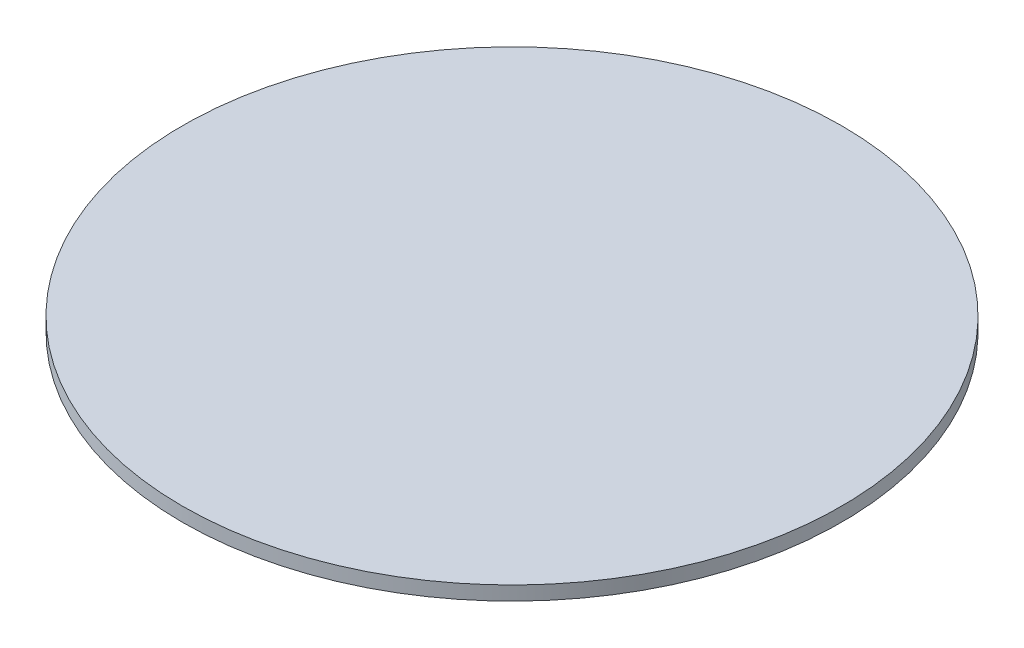
ISO-10303-21;
HEADER;
FILE_DESCRIPTION(('STEP AP214'),'2;1');
FILE_NAME('part.step','',(''),(''),'','','');
FILE_SCHEMA(('AUTOMOTIVE_DESIGN { 1 0 10303 214 1 1 1 1 }'));
ENDSEC;
DATA;
#1=APPLICATION_CONTEXT('core data for automotive mechanical design processes');
#2=APPLICATION_PROTOCOL_DEFINITION('international standard','automotive_design',2000,#1);
#3=PRODUCT_CONTEXT('',#1,'mechanical');
#4=PRODUCT('Part','Part','',(#3));
#5=PRODUCT_RELATED_PRODUCT_CATEGORY('part','',(#4));
#6=PRODUCT_DEFINITION_FORMATION('','',#4);
#7=PRODUCT_DEFINITION_CONTEXT('part definition',#1,'design');
#8=PRODUCT_DEFINITION('design','',#6,#7);
#9=PRODUCT_DEFINITION_SHAPE('','',#8);
#10=(LENGTH_UNIT() NAMED_UNIT(*) SI_UNIT(.MILLI.,.METRE.));
#11=(NAMED_UNIT(*) PLANE_ANGLE_UNIT() SI_UNIT($,.RADIAN.));
#12=(NAMED_UNIT(*) SI_UNIT($,.STERADIAN.) SOLID_ANGLE_UNIT());
#13=UNCERTAINTY_MEASURE_WITH_UNIT(LENGTH_MEASURE(1.E-05),#10,'distance_accuracy_value','');
#14=(GEOMETRIC_REPRESENTATION_CONTEXT(3) GLOBAL_UNCERTAINTY_ASSIGNED_CONTEXT((#13)) GLOBAL_UNIT_ASSIGNED_CONTEXT((#10,
#11,#12)) REPRESENTATION_CONTEXT('',''));
#15=CARTESIAN_POINT('',(0.,0.,0.));
#16=DIRECTION('',(0.,0.,1.));
#17=DIRECTION('',(1.,0.,0.));
#18=AXIS2_PLACEMENT_3D('',#15,#16,#17);
#19=CARTESIAN_POINT('',(0.,1.7,0.));
#20=DIRECTION('',(0.,-1.,0.));
#21=DIRECTION('',(0.,0.,-1.));
#22=AXIS2_PLACEMENT_3D('',#19,#20,#21);
#23=CYLINDRICAL_SURFACE('',#22,40.);
#24=CARTESIAN_POINT('',(0.,1.7,0.));
#25=DIRECTION('',(0.,1.,0.));
#26=DIRECTION('',(0.,0.,1.));
#27=AXIS2_PLACEMENT_3D('',#24,#25,#26);
#28=CIRCLE('',#27,40.);
#29=CARTESIAN_POINT('',(0.,1.7,40.));
#30=VERTEX_POINT('',#29);
#31=EDGE_CURVE('E10',#30,#30,#28,.T.);
#32=ORIENTED_EDGE('',*,*,#31,.F.);
#33=EDGE_LOOP('',(#32));
#34=FACE_BOUND('',#33,.T.);
#35=CARTESIAN_POINT('',(0.,0.,0.));
#36=DIRECTION('',(0.,1.,0.));
#37=DIRECTION('',(0.,0.,1.));
#38=AXIS2_PLACEMENT_3D('',#35,#36,#37);
#39=CIRCLE('',#38,40.);
#40=CARTESIAN_POINT('',(0.,0.,40.));
#41=VERTEX_POINT('',#40);
#42=EDGE_CURVE('E34',#41,#41,#39,.T.);
#43=ORIENTED_EDGE('',*,*,#42,.T.);
#44=EDGE_LOOP('',(#43));
#45=FACE_BOUND('',#44,.T.);
#46=ADVANCED_FACE('F31',(#34,#45),#23,.T.);
#47=CARTESIAN_POINT('',(0.,1.7,0.));
#48=DIRECTION('',(0.,1.,0.));
#49=DIRECTION('',(0.,0.,1.));
#50=AXIS2_PLACEMENT_3D('',#47,#48,#49);
#51=PLANE('',#50);
#52=ORIENTED_EDGE('',*,*,#31,.T.);
#53=EDGE_LOOP('',(#52));
#54=FACE_BOUND('',#53,.T.);
#55=ADVANCED_FACE('F46',(#54),#51,.T.);
#56=CARTESIAN_POINT('',(0.,0.,0.));
#57=DIRECTION('',(0.,1.,0.));
#58=DIRECTION('',(0.,0.,1.));
#59=AXIS2_PLACEMENT_3D('',#56,#57,#58);
#60=PLANE('',#59);
#61=ORIENTED_EDGE('',*,*,#42,.F.);
#62=EDGE_LOOP('',(#61));
#63=FACE_BOUND('',#62,.T.);
#64=ADVANCED_FACE('F44',(#63),#60,.F.);
#65=CLOSED_SHELL('',(#46,#55,#64));
#66=MANIFOLD_SOLID_BREP('B2',#65);
#67=ADVANCED_BREP_SHAPE_REPRESENTATION('',(#18,#66),#14);
#68=SHAPE_DEFINITION_REPRESENTATION(#9,#67);
ENDSEC;
END-ISO-10303-21;
